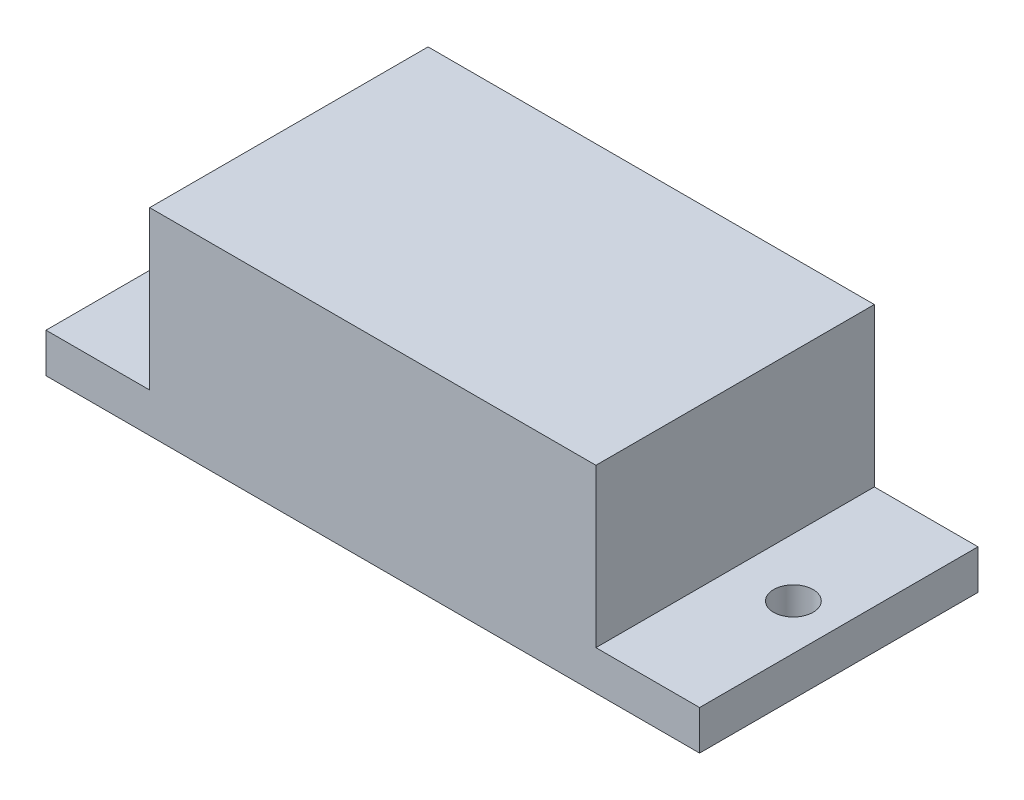
ISO-10303-21;
HEADER;
FILE_DESCRIPTION(('STEP AP214'),'2;1');
FILE_NAME('part.step','',(''),(''),'','','');
FILE_SCHEMA(('AUTOMOTIVE_DESIGN { 1 0 10303 214 1 1 1 1 }'));
ENDSEC;
DATA;
#1=APPLICATION_CONTEXT('core data for automotive mechanical design processes');
#2=APPLICATION_PROTOCOL_DEFINITION('international standard','automotive_design',2000,#1);
#3=PRODUCT_CONTEXT('',#1,'mechanical');
#4=PRODUCT('Part','Part','',(#3));
#5=PRODUCT_RELATED_PRODUCT_CATEGORY('part','',(#4));
#6=PRODUCT_DEFINITION_FORMATION('','',#4);
#7=PRODUCT_DEFINITION_CONTEXT('part definition',#1,'design');
#8=PRODUCT_DEFINITION('design','',#6,#7);
#9=PRODUCT_DEFINITION_SHAPE('','',#8);
#10=(LENGTH_UNIT() NAMED_UNIT(*) SI_UNIT(.MILLI.,.METRE.));
#11=(NAMED_UNIT(*) PLANE_ANGLE_UNIT() SI_UNIT($,.RADIAN.));
#12=(NAMED_UNIT(*) SI_UNIT($,.STERADIAN.) SOLID_ANGLE_UNIT());
#13=UNCERTAINTY_MEASURE_WITH_UNIT(LENGTH_MEASURE(1.E-05),#10,'distance_accuracy_value','');
#14=(GEOMETRIC_REPRESENTATION_CONTEXT(3) GLOBAL_UNCERTAINTY_ASSIGNED_CONTEXT((#13)) GLOBAL_UNIT_ASSIGNED_CONTEXT((#10,
#11,#12)) REPRESENTATION_CONTEXT('',''));
#15=CARTESIAN_POINT('',(0.,0.,0.));
#16=DIRECTION('',(0.,0.,1.));
#17=DIRECTION('',(1.,0.,0.));
#18=AXIS2_PLACEMENT_3D('',#15,#16,#17);
#19=CARTESIAN_POINT('',(11.3,8.,7.05));
#20=DIRECTION('',(-1.,0.,0.));
#21=DIRECTION('',(0.,0.,1.));
#22=AXIS2_PLACEMENT_3D('',#19,#20,#21);
#23=PLANE('',#22);
#24=DIRECTION('',(0.,0.,-1.));
#25=VECTOR('',#24,1.);
#26=CARTESIAN_POINT('',(11.3,0.,7.05));
#27=LINE('',#26,#25);
#28=CARTESIAN_POINT('',(11.3,0.,7.05));
#29=VERTEX_POINT('',#28);
#30=CARTESIAN_POINT('',(11.3,0.,-7.05));
#31=VERTEX_POINT('',#30);
#32=EDGE_CURVE('E125',#29,#31,#27,.T.);
#33=ORIENTED_EDGE('',*,*,#32,.T.);
#34=DIRECTION('',(0.,-1.,0.));
#35=VECTOR('',#34,1.);
#36=CARTESIAN_POINT('',(11.3,8.,-7.05));
#37=LINE('',#36,#35);
#38=CARTESIAN_POINT('',(11.3,8.,-7.05));
#39=VERTEX_POINT('',#38);
#40=EDGE_CURVE('E11',#39,#31,#37,.T.);
#41=ORIENTED_EDGE('',*,*,#40,.F.);
#42=DIRECTION('',(0.,0.,-1.));
#43=VECTOR('',#42,1.);
#44=CARTESIAN_POINT('',(11.3,8.,7.05));
#45=LINE('',#44,#43);
#46=CARTESIAN_POINT('',(11.3,8.,7.05));
#47=VERTEX_POINT('',#46);
#48=EDGE_CURVE('E134',#47,#39,#45,.T.);
#49=ORIENTED_EDGE('',*,*,#48,.F.);
#50=DIRECTION('',(0.,-1.,0.));
#51=VECTOR('',#50,1.);
#52=CARTESIAN_POINT('',(11.3,8.,7.05));
#53=LINE('',#52,#51);
#54=EDGE_CURVE('E140',#47,#29,#53,.T.);
#55=ORIENTED_EDGE('',*,*,#54,.T.);
#56=EDGE_LOOP('',(#33,#41,#49,#55));
#57=FACE_BOUND('',#56,.T.);
#58=ADVANCED_FACE('F38',(#57),#23,.F.);
#59=CARTESIAN_POINT('',(-11.3,8.,-7.05));
#60=DIRECTION('',(0.,0.,1.));
#61=DIRECTION('',(1.,0.,0.));
#62=AXIS2_PLACEMENT_3D('',#59,#60,#61);
#63=PLANE('',#62);
#64=ORIENTED_EDGE('',*,*,#40,.T.);
#65=DIRECTION('',(1.,0.,0.));
#66=VECTOR('',#65,1.);
#67=CARTESIAN_POINT('',(-16.55,0.,-7.05));
#68=LINE('',#67,#66);
#69=CARTESIAN_POINT('',(16.55,0.,-7.05));
#70=VERTEX_POINT('',#69);
#71=EDGE_CURVE('E161',#31,#70,#68,.T.);
#72=ORIENTED_EDGE('',*,*,#71,.T.);
#73=DIRECTION('',(0.,1.,0.));
#74=VECTOR('',#73,1.);
#75=CARTESIAN_POINT('',(16.55,-2.,-7.05));
#76=LINE('',#75,#74);
#77=CARTESIAN_POINT('',(16.55,-2.,-7.05));
#78=VERTEX_POINT('',#77);
#79=EDGE_CURVE('E167',#78,#70,#76,.T.);
#80=ORIENTED_EDGE('',*,*,#79,.F.);
#81=DIRECTION('',(1.,0.,0.));
#82=VECTOR('',#81,1.);
#83=CARTESIAN_POINT('',(-16.55,-2.,-7.05));
#84=LINE('',#83,#82);
#85=CARTESIAN_POINT('',(-16.55,-2.,-7.05));
#86=VERTEX_POINT('',#85);
#87=EDGE_CURVE('E116',#86,#78,#84,.T.);
#88=ORIENTED_EDGE('',*,*,#87,.F.);
#89=DIRECTION('',(0.,1.,0.));
#90=VECTOR('',#89,1.);
#91=CARTESIAN_POINT('',(-16.55,-2.,-7.05));
#92=LINE('',#91,#90);
#93=CARTESIAN_POINT('',(-16.55,0.,-7.05));
#94=VERTEX_POINT('',#93);
#95=EDGE_CURVE('E130',#86,#94,#92,.T.);
#96=ORIENTED_EDGE('',*,*,#95,.T.);
#97=CARTESIAN_POINT('',(-11.3,0.,-7.05));
#98=VERTEX_POINT('',#97);
#99=EDGE_CURVE('E120',#94,#98,#68,.T.);
#100=ORIENTED_EDGE('',*,*,#99,.T.);
#101=DIRECTION('',(0.,-1.,0.));
#102=VECTOR('',#101,1.);
#103=CARTESIAN_POINT('',(-11.3,8.,-7.05));
#104=LINE('',#103,#102);
#105=CARTESIAN_POINT('',(-11.3,8.,-7.05));
#106=VERTEX_POINT('',#105);
#107=EDGE_CURVE('E46',#106,#98,#104,.T.);
#108=ORIENTED_EDGE('',*,*,#107,.F.);
#109=DIRECTION('',(-1.,0.,0.));
#110=VECTOR('',#109,1.);
#111=CARTESIAN_POINT('',(-11.3,8.,-7.05));
#112=LINE('',#111,#110);
#113=EDGE_CURVE('E136',#39,#106,#112,.T.);
#114=ORIENTED_EDGE('',*,*,#113,.F.);
#115=EDGE_LOOP('',(#64,#72,#80,#88,#96,#100,#108,#114));
#116=FACE_BOUND('',#115,.T.);
#117=ADVANCED_FACE('F155',(#116),#63,.F.);
#118=CARTESIAN_POINT('',(-11.3,8.,7.05));
#119=DIRECTION('',(1.,0.,0.));
#120=DIRECTION('',(0.,0.,-1.));
#121=AXIS2_PLACEMENT_3D('',#118,#119,#120);
#122=PLANE('',#121);
#123=DIRECTION('',(0.,0.,1.));
#124=VECTOR('',#123,1.);
#125=CARTESIAN_POINT('',(-11.3,0.,7.05));
#126=LINE('',#125,#124);
#127=CARTESIAN_POINT('',(-11.3,0.,7.05));
#128=VERTEX_POINT('',#127);
#129=EDGE_CURVE('E128',#98,#128,#126,.T.);
#130=ORIENTED_EDGE('',*,*,#129,.T.);
#131=DIRECTION('',(0.,-1.,0.));
#132=VECTOR('',#131,1.);
#133=CARTESIAN_POINT('',(-11.3,8.,7.05));
#134=LINE('',#133,#132);
#135=CARTESIAN_POINT('',(-11.3,8.,7.05));
#136=VERTEX_POINT('',#135);
#137=EDGE_CURVE('E146',#136,#128,#134,.T.);
#138=ORIENTED_EDGE('',*,*,#137,.F.);
#139=DIRECTION('',(0.,0.,1.));
#140=VECTOR('',#139,1.);
#141=CARTESIAN_POINT('',(-11.3,8.,7.05));
#142=LINE('',#141,#140);
#143=EDGE_CURVE('E138',#106,#136,#142,.T.);
#144=ORIENTED_EDGE('',*,*,#143,.F.);
#145=ORIENTED_EDGE('',*,*,#107,.T.);
#146=EDGE_LOOP('',(#130,#138,#144,#145));
#147=FACE_BOUND('',#146,.T.);
#148=ADVANCED_FACE('F151',(#147),#122,.F.);
#149=CARTESIAN_POINT('',(-11.3,8.,7.05));
#150=DIRECTION('',(0.,0.,-1.));
#151=DIRECTION('',(-1.,0.,0.));
#152=AXIS2_PLACEMENT_3D('',#149,#150,#151);
#153=PLANE('',#152);
#154=ORIENTED_EDGE('',*,*,#137,.T.);
#155=DIRECTION('',(-1.,0.,0.));
#156=VECTOR('',#155,1.);
#157=CARTESIAN_POINT('',(-16.55,0.,7.05));
#158=LINE('',#157,#156);
#159=CARTESIAN_POINT('',(-16.55,0.,7.05));
#160=VERTEX_POINT('',#159);
#161=EDGE_CURVE('E171',#128,#160,#158,.T.);
#162=ORIENTED_EDGE('',*,*,#161,.T.);
#163=DIRECTION('',(0.,1.,0.));
#164=VECTOR('',#163,1.);
#165=CARTESIAN_POINT('',(-16.55,-2.,7.05));
#166=LINE('',#165,#164);
#167=CARTESIAN_POINT('',(-16.55,-2.,7.05));
#168=VERTEX_POINT('',#167);
#169=EDGE_CURVE('E107',#168,#160,#166,.T.);
#170=ORIENTED_EDGE('',*,*,#169,.F.);
#171=DIRECTION('',(-1.,0.,0.));
#172=VECTOR('',#171,1.);
#173=CARTESIAN_POINT('',(-16.55,-2.,7.05));
#174=LINE('',#173,#172);
#175=CARTESIAN_POINT('',(16.55,-2.,7.05));
#176=VERTEX_POINT('',#175);
#177=EDGE_CURVE('E98',#176,#168,#174,.T.);
#178=ORIENTED_EDGE('',*,*,#177,.F.);
#179=DIRECTION('',(0.,1.,0.));
#180=VECTOR('',#179,1.);
#181=CARTESIAN_POINT('',(16.55,-2.,7.05));
#182=LINE('',#181,#180);
#183=CARTESIAN_POINT('',(16.55,0.,7.05));
#184=VERTEX_POINT('',#183);
#185=EDGE_CURVE('E104',#176,#184,#182,.T.);
#186=ORIENTED_EDGE('',*,*,#185,.T.);
#187=EDGE_CURVE('E173',#184,#29,#158,.T.);
#188=ORIENTED_EDGE('',*,*,#187,.T.);
#189=ORIENTED_EDGE('',*,*,#54,.F.);
#190=DIRECTION('',(1.,0.,0.));
#191=VECTOR('',#190,1.);
#192=CARTESIAN_POINT('',(-11.3,8.,7.05));
#193=LINE('',#192,#191);
#194=EDGE_CURVE('E53',#136,#47,#193,.T.);
#195=ORIENTED_EDGE('',*,*,#194,.F.);
#196=EDGE_LOOP('',(#154,#162,#170,#178,#186,#188,#189,#195));
#197=FACE_BOUND('',#196,.T.);
#198=ADVANCED_FACE('F101',(#197),#153,.F.);
#199=CARTESIAN_POINT('',(0.,8.,0.));
#200=DIRECTION('',(0.,-1.,0.));
#201=DIRECTION('',(0.,0.,-1.));
#202=AXIS2_PLACEMENT_3D('',#199,#200,#201);
#203=PLANE('',#202);
#204=ORIENTED_EDGE('',*,*,#48,.T.);
#205=ORIENTED_EDGE('',*,*,#113,.T.);
#206=ORIENTED_EDGE('',*,*,#143,.T.);
#207=ORIENTED_EDGE('',*,*,#194,.T.);
#208=EDGE_LOOP('',(#204,#205,#206,#207));
#209=FACE_BOUND('',#208,.T.);
#210=ADVANCED_FACE('F187',(#209),#203,.F.);
#211=CARTESIAN_POINT('',(0.,0.,0.));
#212=DIRECTION('',(0.,1.,0.));
#213=DIRECTION('',(0.,0.,1.));
#214=AXIS2_PLACEMENT_3D('',#211,#212,#213);
#215=PLANE('',#214);
#216=CARTESIAN_POINT('',(14.25,0.,0.));
#217=DIRECTION('',(0.,1.,0.));
#218=DIRECTION('',(0.,0.,1.));
#219=AXIS2_PLACEMENT_3D('',#216,#217,#218);
#220=CIRCLE('',#219,0.999999999999987);
#221=CARTESIAN_POINT('',(14.25,0.,0.999999999999982));
#222=VERTEX_POINT('',#221);
#223=EDGE_CURVE('E318',#222,#222,#220,.T.);
#224=ORIENTED_EDGE('',*,*,#223,.F.);
#225=EDGE_LOOP('',(#224));
#226=FACE_BOUND('',#225,.T.);
#227=ORIENTED_EDGE('',*,*,#32,.F.);
#228=ORIENTED_EDGE('',*,*,#187,.F.);
#229=DIRECTION('',(0.,0.,1.));
#230=VECTOR('',#229,1.);
#231=CARTESIAN_POINT('',(16.55,0.,-7.05));
#232=LINE('',#231,#230);
#233=EDGE_CURVE('E124',#70,#184,#232,.T.);
#234=ORIENTED_EDGE('',*,*,#233,.F.);
#235=ORIENTED_EDGE('',*,*,#71,.F.);
#236=EDGE_LOOP('',(#227,#228,#234,#235));
#237=FACE_BOUND('',#236,.T.);
#238=ADVANCED_FACE('F179',(#226,#237),#215,.T.);
#239=CARTESIAN_POINT('',(-14.25,0.,0.));
#240=DIRECTION('',(0.,1.,0.));
#241=DIRECTION('',(0.,0.,1.));
#242=AXIS2_PLACEMENT_3D('',#239,#240,#241);
#243=CIRCLE('',#242,0.999999999999987);
#244=CARTESIAN_POINT('',(-14.25,0.,0.999999999999987));
#245=VERTEX_POINT('',#244);
#246=EDGE_CURVE('E316',#245,#245,#243,.T.);
#247=ORIENTED_EDGE('',*,*,#246,.F.);
#248=EDGE_LOOP('',(#247));
#249=FACE_BOUND('',#248,.T.);
#250=ORIENTED_EDGE('',*,*,#129,.F.);
#251=ORIENTED_EDGE('',*,*,#99,.F.);
#252=DIRECTION('',(0.,0.,-1.));
#253=VECTOR('',#252,1.);
#254=CARTESIAN_POINT('',(-16.55,0.,-7.05));
#255=LINE('',#254,#253);
#256=EDGE_CURVE('E163',#160,#94,#255,.T.);
#257=ORIENTED_EDGE('',*,*,#256,.F.);
#258=ORIENTED_EDGE('',*,*,#161,.F.);
#259=EDGE_LOOP('',(#250,#251,#257,#258));
#260=FACE_BOUND('',#259,.T.);
#261=ADVANCED_FACE('F177',(#249,#260),#215,.T.);
#262=CARTESIAN_POINT('',(16.55,-2.,-7.05));
#263=DIRECTION('',(-1.,0.,0.));
#264=DIRECTION('',(0.,0.,1.));
#265=AXIS2_PLACEMENT_3D('',#262,#263,#264);
#266=PLANE('',#265);
#267=ORIENTED_EDGE('',*,*,#233,.T.);
#268=ORIENTED_EDGE('',*,*,#185,.F.);
#269=DIRECTION('',(0.,0.,1.));
#270=VECTOR('',#269,1.);
#271=CARTESIAN_POINT('',(16.55,-2.,-7.05));
#272=LINE('',#271,#270);
#273=EDGE_CURVE('E111',#78,#176,#272,.T.);
#274=ORIENTED_EDGE('',*,*,#273,.F.);
#275=ORIENTED_EDGE('',*,*,#79,.T.);
#276=EDGE_LOOP('',(#267,#268,#274,#275));
#277=FACE_BOUND('',#276,.T.);
#278=ADVANCED_FACE('F122',(#277),#266,.F.);
#279=CARTESIAN_POINT('',(-16.55,-2.,-7.05));
#280=DIRECTION('',(1.,0.,0.));
#281=DIRECTION('',(0.,0.,-1.));
#282=AXIS2_PLACEMENT_3D('',#279,#280,#281);
#283=PLANE('',#282);
#284=ORIENTED_EDGE('',*,*,#256,.T.);
#285=ORIENTED_EDGE('',*,*,#95,.F.);
#286=DIRECTION('',(0.,0.,-1.));
#287=VECTOR('',#286,1.);
#288=CARTESIAN_POINT('',(-16.55,-2.,-7.05));
#289=LINE('',#288,#287);
#290=EDGE_CURVE('E110',#168,#86,#289,.T.);
#291=ORIENTED_EDGE('',*,*,#290,.F.);
#292=ORIENTED_EDGE('',*,*,#169,.T.);
#293=EDGE_LOOP('',(#284,#285,#291,#292));
#294=FACE_BOUND('',#293,.T.);
#295=ADVANCED_FACE('F176',(#294),#283,.F.);
#296=CARTESIAN_POINT('',(0.,-2.,0.));
#297=DIRECTION('',(0.,1.,0.));
#298=DIRECTION('',(0.,0.,1.));
#299=AXIS2_PLACEMENT_3D('',#296,#297,#298);
#300=PLANE('',#299);
#301=CARTESIAN_POINT('',(-14.25,-2.,0.));
#302=DIRECTION('',(0.,1.,0.));
#303=DIRECTION('',(0.,0.,1.));
#304=AXIS2_PLACEMENT_3D('',#301,#302,#303);
#305=CIRCLE('',#304,0.999999999999993);
#306=CARTESIAN_POINT('',(-14.25,-2.,0.999999999999993));
#307=VERTEX_POINT('',#306);
#308=EDGE_CURVE('E314',#307,#307,#305,.T.);
#309=ORIENTED_EDGE('',*,*,#308,.T.);
#310=EDGE_LOOP('',(#309));
#311=FACE_BOUND('',#310,.T.);
#312=CARTESIAN_POINT('',(14.25,-2.,0.));
#313=DIRECTION('',(0.,1.,0.));
#314=DIRECTION('',(0.,0.,1.));
#315=AXIS2_PLACEMENT_3D('',#312,#313,#314);
#316=CIRCLE('',#315,0.999999999999993);
#317=CARTESIAN_POINT('',(14.25,-2.,0.999999999999988));
#318=VERTEX_POINT('',#317);
#319=EDGE_CURVE('E172',#318,#318,#316,.T.);
#320=ORIENTED_EDGE('',*,*,#319,.T.);
#321=EDGE_LOOP('',(#320));
#322=FACE_BOUND('',#321,.T.);
#323=ORIENTED_EDGE('',*,*,#273,.T.);
#324=ORIENTED_EDGE('',*,*,#177,.T.);
#325=ORIENTED_EDGE('',*,*,#290,.T.);
#326=ORIENTED_EDGE('',*,*,#87,.T.);
#327=EDGE_LOOP('',(#323,#324,#325,#326));
#328=FACE_BOUND('',#327,.T.);
#329=ADVANCED_FACE('F114',(#311,#322,#328),#300,.F.);
#330=CARTESIAN_POINT('',(14.25,0.,0.));
#331=DIRECTION('',(0.,1.,0.));
#332=DIRECTION('',(0.,0.,1.));
#333=AXIS2_PLACEMENT_3D('',#330,#331,#332);
#334=CYLINDRICAL_SURFACE('',#333,0.999999999999993);
#335=ORIENTED_EDGE('',*,*,#319,.F.);
#336=EDGE_LOOP('',(#335));
#337=FACE_BOUND('',#336,.T.);
#338=ORIENTED_EDGE('',*,*,#223,.T.);
#339=EDGE_LOOP('',(#338));
#340=FACE_BOUND('',#339,.T.);
#341=ADVANCED_FACE('F228',(#337,#340),#334,.F.);
#342=CARTESIAN_POINT('',(-14.25,0.,0.));
#343=DIRECTION('',(0.,1.,0.));
#344=DIRECTION('',(0.,0.,1.));
#345=AXIS2_PLACEMENT_3D('',#342,#343,#344);
#346=CYLINDRICAL_SURFACE('',#345,0.999999999999993);
#347=ORIENTED_EDGE('',*,*,#308,.F.);
#348=EDGE_LOOP('',(#347));
#349=FACE_BOUND('',#348,.T.);
#350=ORIENTED_EDGE('',*,*,#246,.T.);
#351=EDGE_LOOP('',(#350));
#352=FACE_BOUND('',#351,.T.);
#353=ADVANCED_FACE('F298',(#349,#352),#346,.F.);
#354=CLOSED_SHELL('',(#58,#117,#148,#198,#210,#238,#261,#278,#295,#329,#341,#353));
#355=MANIFOLD_SOLID_BREP('B2',#354);
#356=ADVANCED_BREP_SHAPE_REPRESENTATION('',(#18,#355),#14);
#357=SHAPE_DEFINITION_REPRESENTATION(#9,#356);
ENDSEC;
END-ISO-10303-21;
